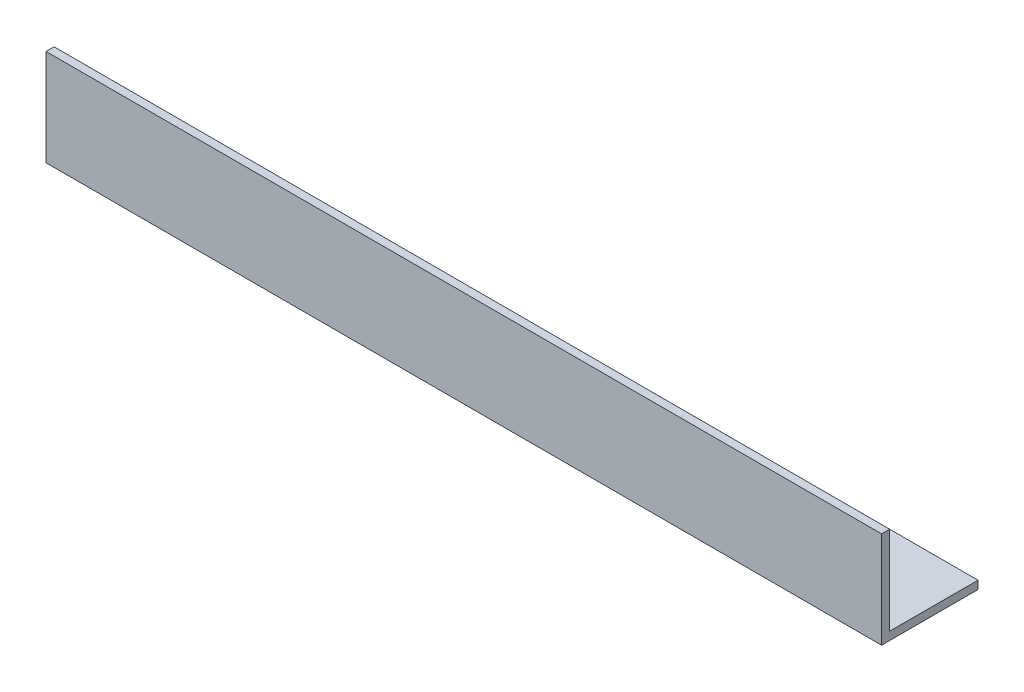
ISO-10303-21;
HEADER;
FILE_DESCRIPTION(('STEP AP214'),'2;1');
FILE_NAME('part.step','',(''),(''),'','','');
FILE_SCHEMA(('AUTOMOTIVE_DESIGN { 1 0 10303 214 1 1 1 1 }'));
ENDSEC;
DATA;
#1=APPLICATION_CONTEXT('core data for automotive mechanical design processes');
#2=APPLICATION_PROTOCOL_DEFINITION('international standard','automotive_design',2000,#1);
#3=PRODUCT_CONTEXT('',#1,'mechanical');
#4=PRODUCT('Part','Part','',(#3));
#5=PRODUCT_RELATED_PRODUCT_CATEGORY('part','',(#4));
#6=PRODUCT_DEFINITION_FORMATION('','',#4);
#7=PRODUCT_DEFINITION_CONTEXT('part definition',#1,'design');
#8=PRODUCT_DEFINITION('design','',#6,#7);
#9=PRODUCT_DEFINITION_SHAPE('','',#8);
#10=(LENGTH_UNIT() NAMED_UNIT(*) SI_UNIT(.MILLI.,.METRE.));
#11=(NAMED_UNIT(*) PLANE_ANGLE_UNIT() SI_UNIT($,.RADIAN.));
#12=(NAMED_UNIT(*) SI_UNIT($,.STERADIAN.) SOLID_ANGLE_UNIT());
#13=UNCERTAINTY_MEASURE_WITH_UNIT(LENGTH_MEASURE(1.E-05),#10,'distance_accuracy_value','');
#14=(GEOMETRIC_REPRESENTATION_CONTEXT(3) GLOBAL_UNCERTAINTY_ASSIGNED_CONTEXT((#13)) GLOBAL_UNIT_ASSIGNED_CONTEXT((#10,
#11,#12)) REPRESENTATION_CONTEXT('',''));
#15=CARTESIAN_POINT('',(0.,0.,0.));
#16=DIRECTION('',(0.,0.,1.));
#17=DIRECTION('',(1.,0.,0.));
#18=AXIS2_PLACEMENT_3D('',#15,#16,#17);
#19=CARTESIAN_POINT('',(165.1,0.,-19.05));
#20=DIRECTION('',(0.,1.,0.));
#21=DIRECTION('',(0.,0.,1.));
#22=AXIS2_PLACEMENT_3D('',#19,#20,#21);
#23=PLANE('',#22);
#24=DIRECTION('',(0.,0.,-1.));
#25=VECTOR('',#24,1.);
#26=CARTESIAN_POINT('',(0.,0.,-19.05));
#27=LINE('',#26,#25);
#28=CARTESIAN_POINT('',(0.,0.,0.));
#29=VERTEX_POINT('',#28);
#30=CARTESIAN_POINT('',(0.,0.,-19.05));
#31=VERTEX_POINT('',#30);
#32=EDGE_CURVE('E119',#29,#31,#27,.T.);
#33=ORIENTED_EDGE('',*,*,#32,.T.);
#34=DIRECTION('',(-1.,0.,0.));
#35=VECTOR('',#34,1.);
#36=CARTESIAN_POINT('',(165.1,0.,-19.05));
#37=LINE('',#36,#35);
#38=CARTESIAN_POINT('',(165.1,0.,-19.05));
#39=VERTEX_POINT('',#38);
#40=EDGE_CURVE('E11',#39,#31,#37,.T.);
#41=ORIENTED_EDGE('',*,*,#40,.F.);
#42=DIRECTION('',(0.,0.,-1.));
#43=VECTOR('',#42,1.);
#44=CARTESIAN_POINT('',(165.1,0.,-19.05));
#45=LINE('',#44,#43);
#46=CARTESIAN_POINT('',(165.1,0.,0.));
#47=VERTEX_POINT('',#46);
#48=EDGE_CURVE('E129',#47,#39,#45,.T.);
#49=ORIENTED_EDGE('',*,*,#48,.F.);
#50=DIRECTION('',(-1.,0.,0.));
#51=VECTOR('',#50,1.);
#52=CARTESIAN_POINT('',(165.1,0.,0.));
#53=LINE('',#52,#51);
#54=EDGE_CURVE('E115',#47,#29,#53,.T.);
#55=ORIENTED_EDGE('',*,*,#54,.T.);
#56=EDGE_LOOP('',(#33,#41,#49,#55));
#57=FACE_BOUND('',#56,.T.);
#58=ADVANCED_FACE('F35',(#57),#23,.F.);
#59=CARTESIAN_POINT('',(165.1,1.6002,-19.05));
#60=DIRECTION('',(0.,0.,1.));
#61=DIRECTION('',(1.,0.,0.));
#62=AXIS2_PLACEMENT_3D('',#59,#60,#61);
#63=PLANE('',#62);
#64=DIRECTION('',(0.,1.,0.));
#65=VECTOR('',#64,1.);
#66=CARTESIAN_POINT('',(0.,1.6002,-19.05));
#67=LINE('',#66,#65);
#68=CARTESIAN_POINT('',(0.,1.6002,-19.05));
#69=VERTEX_POINT('',#68);
#70=EDGE_CURVE('E122',#31,#69,#67,.T.);
#71=ORIENTED_EDGE('',*,*,#70,.T.);
#72=DIRECTION('',(-1.,0.,0.));
#73=VECTOR('',#72,1.);
#74=CARTESIAN_POINT('',(165.1,1.6002,-19.05));
#75=LINE('',#74,#73);
#76=CARTESIAN_POINT('',(165.1,1.6002,-19.05));
#77=VERTEX_POINT('',#76);
#78=EDGE_CURVE('E43',#77,#69,#75,.T.);
#79=ORIENTED_EDGE('',*,*,#78,.F.);
#80=DIRECTION('',(0.,1.,0.));
#81=VECTOR('',#80,1.);
#82=CARTESIAN_POINT('',(165.1,1.6002,-19.05));
#83=LINE('',#82,#81);
#84=EDGE_CURVE('E88',#39,#77,#83,.T.);
#85=ORIENTED_EDGE('',*,*,#84,.F.);
#86=ORIENTED_EDGE('',*,*,#40,.T.);
#87=EDGE_LOOP('',(#71,#79,#85,#86));
#88=FACE_BOUND('',#87,.T.);
#89=ADVANCED_FACE('F153',(#88),#63,.F.);
#90=CARTESIAN_POINT('',(165.1,1.6002,-1.6002));
#91=DIRECTION('',(0.,-1.,0.));
#92=DIRECTION('',(0.,0.,-1.));
#93=AXIS2_PLACEMENT_3D('',#90,#91,#92);
#94=PLANE('',#93);
#95=DIRECTION('',(0.,0.,1.));
#96=VECTOR('',#95,1.);
#97=CARTESIAN_POINT('',(0.,1.6002,-1.6002));
#98=LINE('',#97,#96);
#99=CARTESIAN_POINT('',(0.,1.6002,-1.6002));
#100=VERTEX_POINT('',#99);
#101=EDGE_CURVE('E124',#69,#100,#98,.T.);
#102=ORIENTED_EDGE('',*,*,#101,.T.);
#103=DIRECTION('',(-1.,0.,0.));
#104=VECTOR('',#103,1.);
#105=CARTESIAN_POINT('',(165.1,1.6002,-1.6002));
#106=LINE('',#105,#104);
#107=CARTESIAN_POINT('',(165.1,1.6002,-1.6002));
#108=VERTEX_POINT('',#107);
#109=EDGE_CURVE('E110',#108,#100,#106,.T.);
#110=ORIENTED_EDGE('',*,*,#109,.F.);
#111=DIRECTION('',(0.,0.,1.));
#112=VECTOR('',#111,1.);
#113=CARTESIAN_POINT('',(165.1,1.6002,-1.6002));
#114=LINE('',#113,#112);
#115=EDGE_CURVE('E101',#77,#108,#114,.T.);
#116=ORIENTED_EDGE('',*,*,#115,.F.);
#117=ORIENTED_EDGE('',*,*,#78,.T.);
#118=EDGE_LOOP('',(#102,#110,#116,#117));
#119=FACE_BOUND('',#118,.T.);
#120=ADVANCED_FACE('F135',(#119),#94,.F.);
#121=CARTESIAN_POINT('',(165.1,19.05,-1.6002));
#122=DIRECTION('',(0.,0.,1.));
#123=DIRECTION('',(0.,-1.,0.));
#124=AXIS2_PLACEMENT_3D('',#121,#122,#123);
#125=PLANE('',#124);
#126=DIRECTION('',(0.,1.,0.));
#127=VECTOR('',#126,1.);
#128=CARTESIAN_POINT('',(0.,19.05,-1.6002));
#129=LINE('',#128,#127);
#130=CARTESIAN_POINT('',(0.,19.05,-1.6002));
#131=VERTEX_POINT('',#130);
#132=EDGE_CURVE('E109',#100,#131,#129,.T.);
#133=ORIENTED_EDGE('',*,*,#132,.T.);
#134=DIRECTION('',(-1.,0.,0.));
#135=VECTOR('',#134,1.);
#136=CARTESIAN_POINT('',(165.1,19.05,-1.6002));
#137=LINE('',#136,#135);
#138=CARTESIAN_POINT('',(165.1,19.05,-1.6002));
#139=VERTEX_POINT('',#138);
#140=EDGE_CURVE('E106',#139,#131,#137,.T.);
#141=ORIENTED_EDGE('',*,*,#140,.F.);
#142=DIRECTION('',(0.,1.,0.));
#143=VECTOR('',#142,1.);
#144=CARTESIAN_POINT('',(165.1,19.05,-1.6002));
#145=LINE('',#144,#143);
#146=EDGE_CURVE('E95',#108,#139,#145,.T.);
#147=ORIENTED_EDGE('',*,*,#146,.F.);
#148=ORIENTED_EDGE('',*,*,#109,.T.);
#149=EDGE_LOOP('',(#133,#141,#147,#148));
#150=FACE_BOUND('',#149,.T.);
#151=ADVANCED_FACE('F107',(#150),#125,.F.);
#152=CARTESIAN_POINT('',(165.1,19.05,0.));
#153=DIRECTION('',(0.,-1.,0.));
#154=DIRECTION('',(0.,0.,-1.));
#155=AXIS2_PLACEMENT_3D('',#152,#153,#154);
#156=PLANE('',#155);
#157=DIRECTION('',(0.,0.,1.));
#158=VECTOR('',#157,1.);
#159=CARTESIAN_POINT('',(0.,19.05,0.));
#160=LINE('',#159,#158);
#161=CARTESIAN_POINT('',(0.,19.05,0.));
#162=VERTEX_POINT('',#161);
#163=EDGE_CURVE('E74',#131,#162,#160,.T.);
#164=ORIENTED_EDGE('',*,*,#163,.T.);
#165=DIRECTION('',(-1.,0.,0.));
#166=VECTOR('',#165,1.);
#167=CARTESIAN_POINT('',(165.1,19.05,0.));
#168=LINE('',#167,#166);
#169=CARTESIAN_POINT('',(165.1,19.05,0.));
#170=VERTEX_POINT('',#169);
#171=EDGE_CURVE('E111',#170,#162,#168,.T.);
#172=ORIENTED_EDGE('',*,*,#171,.F.);
#173=DIRECTION('',(0.,0.,1.));
#174=VECTOR('',#173,1.);
#175=CARTESIAN_POINT('',(165.1,19.05,0.));
#176=LINE('',#175,#174);
#177=EDGE_CURVE('E99',#139,#170,#176,.T.);
#178=ORIENTED_EDGE('',*,*,#177,.F.);
#179=ORIENTED_EDGE('',*,*,#140,.T.);
#180=EDGE_LOOP('',(#164,#172,#178,#179));
#181=FACE_BOUND('',#180,.T.);
#182=ADVANCED_FACE('F113',(#181),#156,.F.);
#183=CARTESIAN_POINT('',(165.1,0.,0.));
#184=DIRECTION('',(0.,0.,-1.));
#185=DIRECTION('',(-1.,0.,0.));
#186=AXIS2_PLACEMENT_3D('',#183,#184,#185);
#187=PLANE('',#186);
#188=DIRECTION('',(0.,-1.,0.));
#189=VECTOR('',#188,1.);
#190=CARTESIAN_POINT('',(0.,0.,0.));
#191=LINE('',#190,#189);
#192=EDGE_CURVE('E80',#162,#29,#191,.T.);
#193=ORIENTED_EDGE('',*,*,#192,.T.);
#194=ORIENTED_EDGE('',*,*,#54,.F.);
#195=DIRECTION('',(0.,-1.,0.));
#196=VECTOR('',#195,1.);
#197=CARTESIAN_POINT('',(165.1,0.,0.));
#198=LINE('',#197,#196);
#199=EDGE_CURVE('E51',#170,#47,#198,.T.);
#200=ORIENTED_EDGE('',*,*,#199,.F.);
#201=ORIENTED_EDGE('',*,*,#171,.T.);
#202=EDGE_LOOP('',(#193,#194,#200,#201));
#203=FACE_BOUND('',#202,.T.);
#204=ADVANCED_FACE('F142',(#203),#187,.F.);
#205=CARTESIAN_POINT('',(165.1,0.,0.));
#206=DIRECTION('',(-1.,0.,0.));
#207=DIRECTION('',(0.,0.,1.));
#208=AXIS2_PLACEMENT_3D('',#205,#206,#207);
#209=PLANE('',#208);
#210=ORIENTED_EDGE('',*,*,#48,.T.);
#211=ORIENTED_EDGE('',*,*,#84,.T.);
#212=ORIENTED_EDGE('',*,*,#115,.T.);
#213=ORIENTED_EDGE('',*,*,#146,.T.);
#214=ORIENTED_EDGE('',*,*,#177,.T.);
#215=ORIENTED_EDGE('',*,*,#199,.T.);
#216=EDGE_LOOP('',(#210,#211,#212,#213,#214,#215));
#217=FACE_BOUND('',#216,.T.);
#218=ADVANCED_FACE('F97',(#217),#209,.F.);
#219=CARTESIAN_POINT('',(0.,0.,0.));
#220=DIRECTION('',(-1.,0.,0.));
#221=DIRECTION('',(0.,0.,1.));
#222=AXIS2_PLACEMENT_3D('',#219,#220,#221);
#223=PLANE('',#222);
#224=ORIENTED_EDGE('',*,*,#32,.F.);
#225=ORIENTED_EDGE('',*,*,#192,.F.);
#226=ORIENTED_EDGE('',*,*,#163,.F.);
#227=ORIENTED_EDGE('',*,*,#132,.F.);
#228=ORIENTED_EDGE('',*,*,#101,.F.);
#229=ORIENTED_EDGE('',*,*,#70,.F.);
#230=EDGE_LOOP('',(#224,#225,#226,#227,#228,#229));
#231=FACE_BOUND('',#230,.T.);
#232=ADVANCED_FACE('F138',(#231),#223,.T.);
#233=CLOSED_SHELL('',(#58,#89,#120,#151,#182,#204,#218,#232));
#234=MANIFOLD_SOLID_BREP('B2',#233);
#235=ADVANCED_BREP_SHAPE_REPRESENTATION('',(#18,#234),#14);
#236=SHAPE_DEFINITION_REPRESENTATION(#9,#235);
ENDSEC;
END-ISO-10303-21;
